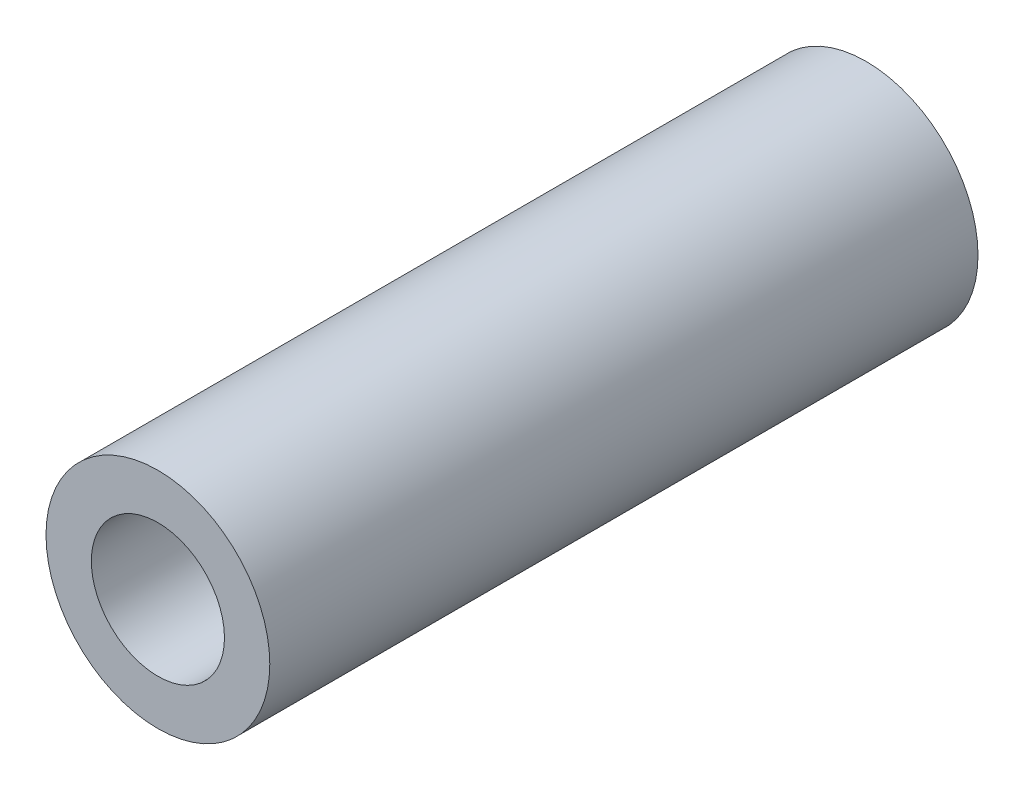
ISO-10303-21;
HEADER;
FILE_DESCRIPTION(('STEP AP214'),'2;1');
FILE_NAME('part.step','',(''),(''),'','','');
FILE_SCHEMA(('AUTOMOTIVE_DESIGN { 1 0 10303 214 1 1 1 1 }'));
ENDSEC;
DATA;
#1=APPLICATION_CONTEXT('core data for automotive mechanical design processes');
#2=APPLICATION_PROTOCOL_DEFINITION('international standard','automotive_design',2000,#1);
#3=PRODUCT_CONTEXT('',#1,'mechanical');
#4=PRODUCT('Part','Part','',(#3));
#5=PRODUCT_RELATED_PRODUCT_CATEGORY('part','',(#4));
#6=PRODUCT_DEFINITION_FORMATION('','',#4);
#7=PRODUCT_DEFINITION_CONTEXT('part definition',#1,'design');
#8=PRODUCT_DEFINITION('design','',#6,#7);
#9=PRODUCT_DEFINITION_SHAPE('','',#8);
#10=(LENGTH_UNIT() NAMED_UNIT(*) SI_UNIT(.MILLI.,.METRE.));
#11=(NAMED_UNIT(*) PLANE_ANGLE_UNIT() SI_UNIT($,.RADIAN.));
#12=(NAMED_UNIT(*) SI_UNIT($,.STERADIAN.) SOLID_ANGLE_UNIT());
#13=UNCERTAINTY_MEASURE_WITH_UNIT(LENGTH_MEASURE(1.E-05),#10,'distance_accuracy_value','');
#14=(GEOMETRIC_REPRESENTATION_CONTEXT(3) GLOBAL_UNCERTAINTY_ASSIGNED_CONTEXT((#13)) GLOBAL_UNIT_ASSIGNED_CONTEXT((#10,
#11,#12)) REPRESENTATION_CONTEXT('',''));
#15=CARTESIAN_POINT('',(0.,0.,0.));
#16=DIRECTION('',(0.,0.,1.));
#17=DIRECTION('',(1.,0.,0.));
#18=AXIS2_PLACEMENT_3D('',#15,#16,#17);
#19=CARTESIAN_POINT('',(0.,0.,-50.));
#20=DIRECTION('',(0.,0.,1.));
#21=DIRECTION('',(1.,0.,0.));
#22=AXIS2_PLACEMENT_3D('',#19,#20,#21);
#23=CYLINDRICAL_SURFACE('',#22,7.9);
#24=CARTESIAN_POINT('',(0.,0.,-50.));
#25=DIRECTION('',(0.,0.,1.));
#26=DIRECTION('',(1.,0.,0.));
#27=AXIS2_PLACEMENT_3D('',#24,#25,#26);
#28=CIRCLE('',#27,7.9);
#29=CARTESIAN_POINT('',(7.9,0.,-50.));
#30=VERTEX_POINT('',#29);
#31=EDGE_CURVE('E10',#30,#30,#28,.T.);
#32=ORIENTED_EDGE('',*,*,#31,.T.);
#33=EDGE_LOOP('',(#32));
#34=FACE_BOUND('',#33,.T.);
#35=CARTESIAN_POINT('',(0.,0.,0.));
#36=DIRECTION('',(0.,0.,1.));
#37=DIRECTION('',(1.,0.,0.));
#38=AXIS2_PLACEMENT_3D('',#35,#36,#37);
#39=CIRCLE('',#38,7.9);
#40=CARTESIAN_POINT('',(7.9,0.,0.));
#41=VERTEX_POINT('',#40);
#42=EDGE_CURVE('E34',#41,#41,#39,.T.);
#43=ORIENTED_EDGE('',*,*,#42,.F.);
#44=EDGE_LOOP('',(#43));
#45=FACE_BOUND('',#44,.T.);
#46=ADVANCED_FACE('F31',(#34,#45),#23,.T.);
#47=CARTESIAN_POINT('',(0.,0.,-50.));
#48=DIRECTION('',(0.,0.,1.));
#49=DIRECTION('',(1.,0.,0.));
#50=AXIS2_PLACEMENT_3D('',#47,#48,#49);
#51=PLANE('',#50);
#52=CARTESIAN_POINT('',(0.,0.,-50.));
#53=DIRECTION('',(0.,0.,1.));
#54=DIRECTION('',(1.,0.,0.));
#55=AXIS2_PLACEMENT_3D('',#52,#53,#54);
#56=CIRCLE('',#55,4.7);
#57=CARTESIAN_POINT('',(4.7,0.,-50.));
#58=VERTEX_POINT('',#57);
#59=EDGE_CURVE('E41',#58,#58,#56,.T.);
#60=ORIENTED_EDGE('',*,*,#59,.T.);
#61=EDGE_LOOP('',(#60));
#62=FACE_BOUND('',#61,.T.);
#63=ORIENTED_EDGE('',*,*,#31,.F.);
#64=EDGE_LOOP('',(#63));
#65=FACE_BOUND('',#64,.T.);
#66=ADVANCED_FACE('F49',(#62,#65),#51,.F.);
#67=CARTESIAN_POINT('',(0.,0.,0.));
#68=DIRECTION('',(0.,0.,1.));
#69=DIRECTION('',(1.,0.,0.));
#70=AXIS2_PLACEMENT_3D('',#67,#68,#69);
#71=PLANE('',#70);
#72=CARTESIAN_POINT('',(0.,0.,0.));
#73=DIRECTION('',(0.,0.,1.));
#74=DIRECTION('',(1.,0.,0.));
#75=AXIS2_PLACEMENT_3D('',#72,#73,#74);
#76=CIRCLE('',#75,4.7);
#77=CARTESIAN_POINT('',(4.7,0.,0.));
#78=VERTEX_POINT('',#77);
#79=EDGE_CURVE('E43',#78,#78,#76,.T.);
#80=ORIENTED_EDGE('',*,*,#79,.F.);
#81=EDGE_LOOP('',(#80));
#82=FACE_BOUND('',#81,.T.);
#83=ORIENTED_EDGE('',*,*,#42,.T.);
#84=EDGE_LOOP('',(#83));
#85=FACE_BOUND('',#84,.T.);
#86=ADVANCED_FACE('F55',(#82,#85),#71,.T.);
#87=CARTESIAN_POINT('',(0.,0.,-50.));
#88=DIRECTION('',(0.,0.,1.));
#89=DIRECTION('',(1.,0.,0.));
#90=AXIS2_PLACEMENT_3D('',#87,#88,#89);
#91=CYLINDRICAL_SURFACE('',#90,4.7);
#92=ORIENTED_EDGE('',*,*,#59,.F.);
#93=EDGE_LOOP('',(#92));
#94=FACE_BOUND('',#93,.T.);
#95=ORIENTED_EDGE('',*,*,#79,.T.);
#96=EDGE_LOOP('',(#95));
#97=FACE_BOUND('',#96,.T.);
#98=ADVANCED_FACE('F52',(#94,#97),#91,.F.);
#99=CLOSED_SHELL('',(#46,#66,#86,#98));
#100=MANIFOLD_SOLID_BREP('B2',#99);
#101=ADVANCED_BREP_SHAPE_REPRESENTATION('',(#18,#100),#14);
#102=SHAPE_DEFINITION_REPRESENTATION(#9,#101);
ENDSEC;
END-ISO-10303-21;
